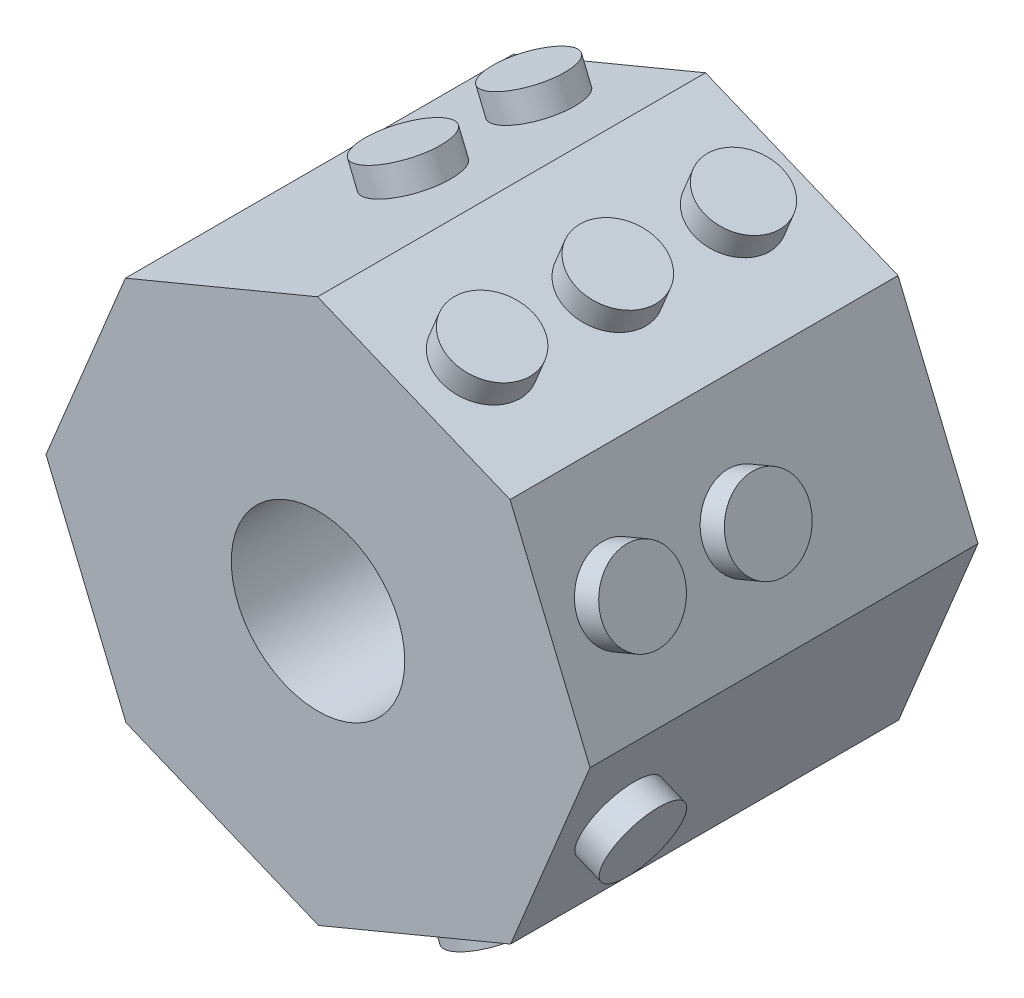
ISO-10303-21;
HEADER;
FILE_DESCRIPTION(('STEP AP214'),'2;1');
FILE_NAME('part.step','',(''),(''),'','','');
FILE_SCHEMA(('AUTOMOTIVE_DESIGN { 1 0 10303 214 1 1 1 1 }'));
ENDSEC;
DATA;
#1=APPLICATION_CONTEXT('core data for automotive mechanical design processes');
#2=APPLICATION_PROTOCOL_DEFINITION('international standard','automotive_design',2000,#1);
#3=PRODUCT_CONTEXT('',#1,'mechanical');
#4=PRODUCT('Part','Part','',(#3));
#5=PRODUCT_RELATED_PRODUCT_CATEGORY('part','',(#4));
#6=PRODUCT_DEFINITION_FORMATION('','',#4);
#7=PRODUCT_DEFINITION_CONTEXT('part definition',#1,'design');
#8=PRODUCT_DEFINITION('design','',#6,#7);
#9=PRODUCT_DEFINITION_SHAPE('','',#8);
#10=(LENGTH_UNIT() NAMED_UNIT(*) SI_UNIT(.MILLI.,.METRE.));
#11=(NAMED_UNIT(*) PLANE_ANGLE_UNIT() SI_UNIT($,.RADIAN.));
#12=(NAMED_UNIT(*) SI_UNIT($,.STERADIAN.) SOLID_ANGLE_UNIT());
#13=UNCERTAINTY_MEASURE_WITH_UNIT(LENGTH_MEASURE(1.E-05),#10,'distance_accuracy_value','');
#14=(GEOMETRIC_REPRESENTATION_CONTEXT(3) GLOBAL_UNCERTAINTY_ASSIGNED_CONTEXT((#13)) GLOBAL_UNIT_ASSIGNED_CONTEXT((#10,
#11,#12)) REPRESENTATION_CONTEXT('',''));
#15=CARTESIAN_POINT('',(0.,0.,0.));
#16=DIRECTION('',(0.,0.,1.));
#17=DIRECTION('',(1.,0.,0.));
#18=AXIS2_PLACEMENT_3D('',#15,#16,#17);
#19=CARTESIAN_POINT('',(3.51446046135657,3.52549293176761,7.1));
#20=DIRECTION('',(-0.381235131692321,-0.924478109185685,0.));
#21=DIRECTION('',(0.924478109185685,-0.381235131692321,0.));
#22=AXIS2_PLACEMENT_3D('',#19,#20,#21);
#23=PLANE('',#22);
#24=CARTESIAN_POINT('',(1.75332966335784,4.25174585764148,5.85));
#25=DIRECTION('',(-0.381235131692321,-0.924478109185685,0.));
#26=DIRECTION('',(0.924478109185685,-0.381235131692321,0.));
#27=AXIS2_PLACEMENT_3D('',#24,#25,#26);
#28=CIRCLE('',#27,0.75);
#29=CARTESIAN_POINT('',(2.44668824524711,3.96581950887224,5.85));
#30=VERTEX_POINT('',#29);
#31=EDGE_CURVE('E195',#30,#30,#28,.F.);
#32=ORIENTED_EDGE('',*,*,#31,.F.);
#33=EDGE_LOOP('',(#32));
#34=FACE_BOUND('',#33,.T.);
#35=CARTESIAN_POINT('',(1.75332966335784,4.25174585764148,3.55));
#36=DIRECTION('',(-0.381235131692321,-0.924478109185685,0.));
#37=DIRECTION('',(0.924478109185685,-0.381235131692321,0.));
#38=AXIS2_PLACEMENT_3D('',#35,#36,#37);
#39=CIRCLE('',#38,0.75);
#40=CARTESIAN_POINT('',(2.44668824524711,3.96581950887224,3.55));
#41=VERTEX_POINT('',#40);
#42=EDGE_CURVE('E191',#41,#41,#39,.F.);
#43=ORIENTED_EDGE('',*,*,#42,.F.);
#44=EDGE_LOOP('',(#43));
#45=FACE_BOUND('',#44,.T.);
#46=CARTESIAN_POINT('',(1.75332966335784,4.25174585764148,1.25));
#47=DIRECTION('',(-0.381235131692321,-0.924478109185685,0.));
#48=DIRECTION('',(0.924478109185685,-0.381235131692321,0.));
#49=AXIS2_PLACEMENT_3D('',#46,#47,#48);
#50=CIRCLE('',#49,0.714611453156265);
#51=CARTESIAN_POINT('',(2.41397230837418,3.97931086618861,1.25));
#52=VERTEX_POINT('',#51);
#53=EDGE_CURVE('E187',#52,#52,#50,.F.);
#54=ORIENTED_EDGE('',*,*,#53,.F.);
#55=EDGE_LOOP('',(#54));
#56=FACE_BOUND('',#55,.T.);
#57=DIRECTION('',(-0.924478109185685,0.381235131692321,0.));
#58=VECTOR('',#57,1.);
#59=CARTESIAN_POINT('',(3.51446046135657,3.52549293176761,0.));
#60=LINE('',#59,#58);
#61=CARTESIAN_POINT('',(3.51446046135657,3.52549293176761,0.));
#62=VERTEX_POINT('',#61);
#63=CARTESIAN_POINT('',(-0.00780113464088632,4.97799878351535,0.));
#64=VERTEX_POINT('',#63);
#65=EDGE_CURVE('E142',#62,#64,#60,.T.);
#66=ORIENTED_EDGE('',*,*,#65,.T.);
#67=DIRECTION('',(0.,0.,-1.));
#68=VECTOR('',#67,1.);
#69=CARTESIAN_POINT('',(-0.00780113464088632,4.97799878351535,7.1));
#70=LINE('',#69,#68);
#71=CARTESIAN_POINT('',(-0.00780113464088632,4.97799878351535,7.1));
#72=VERTEX_POINT('',#71);
#73=EDGE_CURVE('E184',#72,#64,#70,.T.);
#74=ORIENTED_EDGE('',*,*,#73,.F.);
#75=DIRECTION('',(-0.924478109185685,0.381235131692321,0.));
#76=VECTOR('',#75,1.);
#77=CARTESIAN_POINT('',(3.51446046135657,3.52549293176761,7.1));
#78=LINE('',#77,#76);
#79=CARTESIAN_POINT('',(3.51446046135657,3.52549293176761,7.1));
#80=VERTEX_POINT('',#79);
#81=EDGE_CURVE('E165',#80,#72,#78,.T.);
#82=ORIENTED_EDGE('',*,*,#81,.F.);
#83=DIRECTION('',(0.,0.,-1.));
#84=VECTOR('',#83,1.);
#85=CARTESIAN_POINT('',(3.51446046135657,3.52549293176761,7.1));
#86=LINE('',#85,#84);
#87=EDGE_CURVE('E138',#80,#62,#86,.T.);
#88=ORIENTED_EDGE('',*,*,#87,.T.);
#89=EDGE_LOOP('',(#66,#74,#82,#88));
#90=FACE_BOUND('',#89,.T.);
#91=ADVANCED_FACE('F39',(#34,#45,#56,#90),#23,.F.);
#92=CARTESIAN_POINT('',(-0.00780113464088632,4.97799878351535,7.1));
#93=DIRECTION('',(0.384130793217529,-0.923278686909902,0.));
#94=DIRECTION('',(0.923278686909902,0.384130793217529,0.));
#95=AXIS2_PLACEMENT_3D('',#92,#93,#94);
#96=PLANE('',#95);
#97=CARTESIAN_POINT('',(-1.81099768023092,4.22777750233007,3.55));
#98=DIRECTION('',(0.384130793217529,-0.923278686909902,0.));
#99=DIRECTION('',(0.923278686909902,0.384130793217529,0.));
#100=AXIS2_PLACEMENT_3D('',#97,#98,#99);
#101=CIRCLE('',#100,0.75);
#102=CARTESIAN_POINT('',(-1.1185386650485,4.51587559724322,3.55));
#103=VERTEX_POINT('',#102);
#104=EDGE_CURVE('E219',#103,#103,#101,.F.);
#105=ORIENTED_EDGE('',*,*,#104,.F.);
#106=EDGE_LOOP('',(#105));
#107=FACE_BOUND('',#106,.T.);
#108=CARTESIAN_POINT('',(-1.81099768023092,4.22777750233007,1.25));
#109=DIRECTION('',(0.384130793217529,-0.923278686909902,0.));
#110=DIRECTION('',(0.923278686909902,0.384130793217529,0.));
#111=AXIS2_PLACEMENT_3D('',#108,#109,#110);
#112=CIRCLE('',#111,0.714611453156265);
#113=CARTESIAN_POINT('',(-1.15121215611003,4.50228176667332,1.25));
#114=VERTEX_POINT('',#113);
#115=EDGE_CURVE('E216',#114,#114,#112,.F.);
#116=ORIENTED_EDGE('',*,*,#115,.F.);
#117=EDGE_LOOP('',(#116));
#118=FACE_BOUND('',#117,.T.);
#119=DIRECTION('',(-0.923278686909902,-0.384130793217528,0.));
#120=VECTOR('',#119,1.);
#121=CARTESIAN_POINT('',(-0.00780113464088632,4.97799878351535,0.));
#122=LINE('',#121,#120);
#123=CARTESIAN_POINT('',(-3.52549293176761,3.51446046135657,0.));
#124=VERTEX_POINT('',#123);
#125=EDGE_CURVE('E146',#64,#124,#122,.T.);
#126=ORIENTED_EDGE('',*,*,#125,.T.);
#127=DIRECTION('',(0.,0.,-1.));
#128=VECTOR('',#127,1.);
#129=CARTESIAN_POINT('',(-3.52549293176761,3.51446046135657,7.1));
#130=LINE('',#129,#128);
#131=CARTESIAN_POINT('',(-3.52549293176761,3.51446046135657,7.1));
#132=VERTEX_POINT('',#131);
#133=EDGE_CURVE('E180',#132,#124,#130,.T.);
#134=ORIENTED_EDGE('',*,*,#133,.F.);
#135=DIRECTION('',(-0.923278686909902,-0.384130793217528,0.));
#136=VECTOR('',#135,1.);
#137=CARTESIAN_POINT('',(-0.00780113464088632,4.97799878351535,7.1));
#138=LINE('',#137,#136);
#139=EDGE_CURVE('E101',#72,#132,#138,.T.);
#140=ORIENTED_EDGE('',*,*,#139,.F.);
#141=ORIENTED_EDGE('',*,*,#73,.T.);
#142=EDGE_LOOP('',(#126,#134,#140,#141));
#143=FACE_BOUND('',#142,.T.);
#144=ADVANCED_FACE('F234',(#107,#118,#143),#96,.F.);
#145=CARTESIAN_POINT('',(-3.52549293176761,3.51446046135657,7.1));
#146=DIRECTION('',(0.924478109185685,-0.381235131692321,0.));
#147=DIRECTION('',(0.381235131692321,0.924478109185685,0.));
#148=AXIS2_PLACEMENT_3D('',#145,#146,#147);
#149=PLANE('',#148);
#150=CARTESIAN_POINT('',(-4.25174585764148,1.75332966335784,1.25));
#151=DIRECTION('',(0.924478109185685,-0.381235131692321,0.));
#152=DIRECTION('',(0.381235131692321,0.924478109185685,0.));
#153=AXIS2_PLACEMENT_3D('',#150,#151,#152);
#154=CIRCLE('',#153,0.714611453156264);
#155=CARTESIAN_POINT('',(-3.97931086618861,2.41397230837418,1.25));
#156=VERTEX_POINT('',#155);
#157=EDGE_CURVE('E42',#156,#156,#154,.F.);
#158=ORIENTED_EDGE('',*,*,#157,.F.);
#159=EDGE_LOOP('',(#158));
#160=FACE_BOUND('',#159,.T.);
#161=DIRECTION('',(-0.381235131692321,-0.924478109185685,0.));
#162=VECTOR('',#161,1.);
#163=CARTESIAN_POINT('',(-3.52549293176761,3.51446046135657,0.));
#164=LINE('',#163,#162);
#165=CARTESIAN_POINT('',(-4.97799878351535,-0.00780113464088846,0.));
#166=VERTEX_POINT('',#165);
#167=EDGE_CURVE('E150',#124,#166,#164,.T.);
#168=ORIENTED_EDGE('',*,*,#167,.T.);
#169=DIRECTION('',(0.,0.,-1.));
#170=VECTOR('',#169,1.);
#171=CARTESIAN_POINT('',(-4.97799878351535,-0.00780113464088846,7.1));
#172=LINE('',#171,#170);
#173=CARTESIAN_POINT('',(-4.97799878351535,-0.00780113464088846,7.1));
#174=VERTEX_POINT('',#173);
#175=EDGE_CURVE('E176',#174,#166,#172,.T.);
#176=ORIENTED_EDGE('',*,*,#175,.F.);
#177=DIRECTION('',(-0.381235131692321,-0.924478109185685,0.));
#178=VECTOR('',#177,1.);
#179=CARTESIAN_POINT('',(-3.52549293176761,3.51446046135657,7.1));
#180=LINE('',#179,#178);
#181=EDGE_CURVE('E252',#132,#174,#180,.T.);
#182=ORIENTED_EDGE('',*,*,#181,.F.);
#183=ORIENTED_EDGE('',*,*,#133,.T.);
#184=EDGE_LOOP('',(#168,#176,#182,#183));
#185=FACE_BOUND('',#184,.T.);
#186=ADVANCED_FACE('F230',(#160,#185),#149,.F.);
#187=CARTESIAN_POINT('',(-4.97799878351535,-0.00780113464088846,7.1));
#188=DIRECTION('',(0.923278686909902,0.384130793217529,0.));
#189=DIRECTION('',(-0.384130793217529,0.923278686909902,0.));
#190=AXIS2_PLACEMENT_3D('',#187,#188,#189);
#191=PLANE('',#190);
#192=DIRECTION('',(0.384130793217528,-0.923278686909902,0.));
#193=VECTOR('',#192,1.);
#194=CARTESIAN_POINT('',(-4.97799878351535,-0.00780113464088846,0.));
#195=LINE('',#194,#193);
#196=CARTESIAN_POINT('',(-3.51446046135657,-3.52549293176761,0.));
#197=VERTEX_POINT('',#196);
#198=EDGE_CURVE('E153',#166,#197,#195,.T.);
#199=ORIENTED_EDGE('',*,*,#198,.T.);
#200=DIRECTION('',(0.,0.,-1.));
#201=VECTOR('',#200,1.);
#202=CARTESIAN_POINT('',(-3.51446046135657,-3.52549293176761,7.1));
#203=LINE('',#202,#201);
#204=CARTESIAN_POINT('',(-3.51446046135657,-3.52549293176761,7.1));
#205=VERTEX_POINT('',#204);
#206=EDGE_CURVE('E172',#205,#197,#203,.T.);
#207=ORIENTED_EDGE('',*,*,#206,.F.);
#208=DIRECTION('',(0.384130793217528,-0.923278686909902,0.));
#209=VECTOR('',#208,1.);
#210=CARTESIAN_POINT('',(-4.97799878351535,-0.00780113464088846,7.1));
#211=LINE('',#210,#209);
#212=EDGE_CURVE('E244',#174,#205,#211,.T.);
#213=ORIENTED_EDGE('',*,*,#212,.F.);
#214=ORIENTED_EDGE('',*,*,#175,.T.);
#215=EDGE_LOOP('',(#199,#207,#213,#214));
#216=FACE_BOUND('',#215,.T.);
#217=ADVANCED_FACE('F233',(#216),#191,.F.);
#218=CARTESIAN_POINT('',(-3.51446046135657,-3.52549293176761,7.1));
#219=DIRECTION('',(0.381235131692321,0.924478109185685,0.));
#220=DIRECTION('',(-0.924478109185685,0.381235131692321,0.));
#221=AXIS2_PLACEMENT_3D('',#218,#219,#220);
#222=PLANE('',#221);
#223=CARTESIAN_POINT('',(-1.75332966335784,-4.25174585764149,3.55));
#224=DIRECTION('',(-0.38123513169232,-0.924478109185685,0.));
#225=DIRECTION('',(0.924478109185685,-0.38123513169232,0.));
#226=AXIS2_PLACEMENT_3D('',#223,#224,#225);
#227=CIRCLE('',#226,0.75);
#228=CARTESIAN_POINT('',(-1.05997108146858,-4.53767220641073,3.55));
#229=VERTEX_POINT('',#228);
#230=EDGE_CURVE('E11',#229,#229,#227,.T.);
#231=ORIENTED_EDGE('',*,*,#230,.F.);
#232=EDGE_LOOP('',(#231));
#233=FACE_BOUND('',#232,.T.);
#234=DIRECTION('',(0.924478109185685,-0.381235131692321,0.));
#235=VECTOR('',#234,1.);
#236=CARTESIAN_POINT('',(-3.51446046135657,-3.52549293176761,0.));
#237=LINE('',#236,#235);
#238=CARTESIAN_POINT('',(0.00780113464088743,-4.97799878351536,0.));
#239=VERTEX_POINT('',#238);
#240=EDGE_CURVE('E156',#197,#239,#237,.T.);
#241=ORIENTED_EDGE('',*,*,#240,.T.);
#242=DIRECTION('',(0.,0.,-1.));
#243=VECTOR('',#242,1.);
#244=CARTESIAN_POINT('',(0.00780113464088743,-4.97799878351536,7.1));
#245=LINE('',#244,#243);
#246=CARTESIAN_POINT('',(0.00780113464088743,-4.97799878351536,7.1));
#247=VERTEX_POINT('',#246);
#248=EDGE_CURVE('E131',#247,#239,#245,.T.);
#249=ORIENTED_EDGE('',*,*,#248,.F.);
#250=DIRECTION('',(0.924478109185685,-0.381235131692321,0.));
#251=VECTOR('',#250,1.);
#252=CARTESIAN_POINT('',(-3.51446046135657,-3.52549293176761,7.1));
#253=LINE('',#252,#251);
#254=EDGE_CURVE('E120',#205,#247,#253,.T.);
#255=ORIENTED_EDGE('',*,*,#254,.F.);
#256=ORIENTED_EDGE('',*,*,#206,.T.);
#257=EDGE_LOOP('',(#241,#249,#255,#256));
#258=FACE_BOUND('',#257,.T.);
#259=ADVANCED_FACE('F249',(#233,#258),#222,.F.);
#260=CARTESIAN_POINT('',(0.00780113464088743,-4.97799878351536,7.1));
#261=DIRECTION('',(-0.384130793217528,0.923278686909902,0.));
#262=DIRECTION('',(-0.923278686909902,-0.384130793217529,0.));
#263=AXIS2_PLACEMENT_3D('',#260,#261,#262);
#264=PLANE('',#263);
#265=CARTESIAN_POINT('',(1.76664703320425,-4.24622962243596,1.25));
#266=DIRECTION('',(-0.384130793217528,0.923278686909902,0.));
#267=DIRECTION('',(-0.923278686909902,-0.384130793217529,0.));
#268=AXIS2_PLACEMENT_3D('',#265,#266,#267);
#269=CIRCLE('',#268,0.75);
#270=CARTESIAN_POINT('',(1.07418801802182,-4.53432771734911,1.25));
#271=VERTEX_POINT('',#270);
#272=EDGE_CURVE('E212',#271,#271,#269,.F.);
#273=ORIENTED_EDGE('',*,*,#272,.F.);
#274=EDGE_LOOP('',(#273));
#275=FACE_BOUND('',#274,.T.);
#276=CARTESIAN_POINT('',(1.76664703320425,-4.24622962243596,5.85));
#277=DIRECTION('',(-0.384130793217528,0.923278686909902,0.));
#278=DIRECTION('',(-0.923278686909902,-0.384130793217529,0.));
#279=AXIS2_PLACEMENT_3D('',#276,#277,#278);
#280=CIRCLE('',#279,0.714611453156265);
#281=CARTESIAN_POINT('',(1.10686150908336,-4.52073388677921,5.85));
#282=VERTEX_POINT('',#281);
#283=EDGE_CURVE('E208',#282,#282,#280,.F.);
#284=ORIENTED_EDGE('',*,*,#283,.F.);
#285=EDGE_LOOP('',(#284));
#286=FACE_BOUND('',#285,.T.);
#287=DIRECTION('',(0.923278686909902,0.384130793217528,0.));
#288=VECTOR('',#287,1.);
#289=CARTESIAN_POINT('',(0.00780113464088743,-4.97799878351536,0.));
#290=LINE('',#289,#288);
#291=CARTESIAN_POINT('',(3.52549293176761,-3.51446046135657,0.));
#292=VERTEX_POINT('',#291);
#293=EDGE_CURVE('E129',#239,#292,#290,.T.);
#294=ORIENTED_EDGE('',*,*,#293,.T.);
#295=DIRECTION('',(0.,0.,-1.));
#296=VECTOR('',#295,1.);
#297=CARTESIAN_POINT('',(3.52549293176761,-3.51446046135657,7.1));
#298=LINE('',#297,#296);
#299=CARTESIAN_POINT('',(3.52549293176761,-3.51446046135657,7.1));
#300=VERTEX_POINT('',#299);
#301=EDGE_CURVE('E126',#300,#292,#298,.T.);
#302=ORIENTED_EDGE('',*,*,#301,.F.);
#303=DIRECTION('',(0.923278686909902,0.384130793217528,0.));
#304=VECTOR('',#303,1.);
#305=CARTESIAN_POINT('',(0.00780113464088743,-4.97799878351536,7.1));
#306=LINE('',#305,#304);
#307=EDGE_CURVE('E114',#247,#300,#306,.T.);
#308=ORIENTED_EDGE('',*,*,#307,.F.);
#309=ORIENTED_EDGE('',*,*,#248,.T.);
#310=EDGE_LOOP('',(#294,#302,#308,#309));
#311=FACE_BOUND('',#310,.T.);
#312=ADVANCED_FACE('F127',(#275,#286,#311),#264,.F.);
#313=CARTESIAN_POINT('',(3.52549293176761,-3.51446046135657,7.1));
#314=DIRECTION('',(-0.924478109185685,0.381235131692321,0.));
#315=DIRECTION('',(-0.381235131692321,-0.924478109185685,0.));
#316=AXIS2_PLACEMENT_3D('',#313,#314,#315);
#317=PLANE('',#316);
#318=CARTESIAN_POINT('',(4.25174585764149,-1.75332966335784,5.85));
#319=DIRECTION('',(-0.924478109185685,0.381235131692321,0.));
#320=DIRECTION('',(-0.381235131692321,-0.924478109185685,0.));
#321=AXIS2_PLACEMENT_3D('',#318,#319,#320);
#322=CIRCLE('',#321,0.75);
#323=CARTESIAN_POINT('',(3.96581950887224,-2.44668824524711,5.85));
#324=VERTEX_POINT('',#323);
#325=EDGE_CURVE('E204',#324,#324,#322,.F.);
#326=ORIENTED_EDGE('',*,*,#325,.F.);
#327=EDGE_LOOP('',(#326));
#328=FACE_BOUND('',#327,.T.);
#329=DIRECTION('',(0.381235131692321,0.924478109185685,0.));
#330=VECTOR('',#329,1.);
#331=CARTESIAN_POINT('',(3.52549293176761,-3.51446046135657,0.));
#332=LINE('',#331,#330);
#333=CARTESIAN_POINT('',(4.97799878351536,0.0078011346408868,0.));
#334=VERTEX_POINT('',#333);
#335=EDGE_CURVE('E86',#292,#334,#332,.T.);
#336=ORIENTED_EDGE('',*,*,#335,.T.);
#337=DIRECTION('',(0.,0.,-1.));
#338=VECTOR('',#337,1.);
#339=CARTESIAN_POINT('',(4.97799878351536,0.0078011346408868,7.1));
#340=LINE('',#339,#338);
#341=CARTESIAN_POINT('',(4.97799878351536,0.0078011346408868,7.1));
#342=VERTEX_POINT('',#341);
#343=EDGE_CURVE('E132',#342,#334,#340,.T.);
#344=ORIENTED_EDGE('',*,*,#343,.F.);
#345=DIRECTION('',(0.381235131692321,0.924478109185685,0.));
#346=VECTOR('',#345,1.);
#347=CARTESIAN_POINT('',(3.52549293176761,-3.51446046135657,7.1));
#348=LINE('',#347,#346);
#349=EDGE_CURVE('E118',#300,#342,#348,.T.);
#350=ORIENTED_EDGE('',*,*,#349,.F.);
#351=ORIENTED_EDGE('',*,*,#301,.T.);
#352=EDGE_LOOP('',(#336,#344,#350,#351));
#353=FACE_BOUND('',#352,.T.);
#354=ADVANCED_FACE('F134',(#328,#353),#317,.F.);
#355=CARTESIAN_POINT('',(4.97799878351536,0.0078011346408868,7.1));
#356=DIRECTION('',(-0.923278686909902,-0.384130793217528,0.));
#357=DIRECTION('',(0.384130793217528,-0.923278686909902,0.));
#358=AXIS2_PLACEMENT_3D('',#355,#356,#357);
#359=PLANE('',#358);
#360=CARTESIAN_POINT('',(4.24622962243597,1.76664703320425,5.85));
#361=DIRECTION('',(-0.923278686909902,-0.384130793217528,0.));
#362=DIRECTION('',(0.384130793217528,-0.923278686909902,0.));
#363=AXIS2_PLACEMENT_3D('',#360,#361,#362);
#364=CIRCLE('',#363,0.750000000000001);
#365=CARTESIAN_POINT('',(4.53432771734911,1.07418801802182,5.85));
#366=VERTEX_POINT('',#365);
#367=EDGE_CURVE('E200',#366,#366,#364,.F.);
#368=ORIENTED_EDGE('',*,*,#367,.F.);
#369=EDGE_LOOP('',(#368));
#370=FACE_BOUND('',#369,.T.);
#371=CARTESIAN_POINT('',(4.24622962243597,1.76664703320425,3.55));
#372=DIRECTION('',(0.923278686909902,0.384130793217528,0.));
#373=DIRECTION('',(-0.384130793217528,0.923278686909902,0.));
#374=AXIS2_PLACEMENT_3D('',#371,#372,#373);
#375=CIRCLE('',#374,0.75);
#376=CARTESIAN_POINT('',(3.95813152752282,2.45910604838668,3.55));
#377=VERTEX_POINT('',#376);
#378=EDGE_CURVE('E199',#377,#377,#375,.T.);
#379=ORIENTED_EDGE('',*,*,#378,.F.);
#380=EDGE_LOOP('',(#379));
#381=FACE_BOUND('',#380,.T.);
#382=DIRECTION('',(-0.384130793217528,0.923278686909902,0.));
#383=VECTOR('',#382,1.);
#384=CARTESIAN_POINT('',(4.97799878351536,0.0078011346408868,0.));
#385=LINE('',#384,#383);
#386=EDGE_CURVE('E92',#334,#62,#385,.T.);
#387=ORIENTED_EDGE('',*,*,#386,.T.);
#388=ORIENTED_EDGE('',*,*,#87,.F.);
#389=DIRECTION('',(-0.384130793217528,0.923278686909902,0.));
#390=VECTOR('',#389,1.);
#391=CARTESIAN_POINT('',(4.97799878351536,0.0078011346408868,7.1));
#392=LINE('',#391,#390);
#393=EDGE_CURVE('E57',#342,#80,#392,.T.);
#394=ORIENTED_EDGE('',*,*,#393,.F.);
#395=ORIENTED_EDGE('',*,*,#343,.T.);
#396=EDGE_LOOP('',(#387,#388,#394,#395));
#397=FACE_BOUND('',#396,.T.);
#398=ADVANCED_FACE('F329',(#370,#381,#397),#359,.F.);
#399=CARTESIAN_POINT('',(0.,0.,7.1));
#400=DIRECTION('',(0.,0.,1.));
#401=DIRECTION('',(1.,0.,0.));
#402=AXIS2_PLACEMENT_3D('',#399,#400,#401);
#403=PLANE('',#402);
#404=CARTESIAN_POINT('',(0.,0.,7.1));
#405=DIRECTION('',(0.,0.,1.));
#406=DIRECTION('',(1.,0.,0.));
#407=AXIS2_PLACEMENT_3D('',#404,#405,#406);
#408=CIRCLE('',#407,1.5875);
#409=CARTESIAN_POINT('',(1.5875,0.,7.1));
#410=VERTEX_POINT('',#409);
#411=EDGE_CURVE('E312',#410,#410,#408,.T.);
#412=ORIENTED_EDGE('',*,*,#411,.F.);
#413=EDGE_LOOP('',(#412));
#414=FACE_BOUND('',#413,.T.);
#415=ORIENTED_EDGE('',*,*,#81,.T.);
#416=ORIENTED_EDGE('',*,*,#139,.T.);
#417=ORIENTED_EDGE('',*,*,#181,.T.);
#418=ORIENTED_EDGE('',*,*,#212,.T.);
#419=ORIENTED_EDGE('',*,*,#254,.T.);
#420=ORIENTED_EDGE('',*,*,#307,.T.);
#421=ORIENTED_EDGE('',*,*,#349,.T.);
#422=ORIENTED_EDGE('',*,*,#393,.T.);
#423=EDGE_LOOP('',(#415,#416,#417,#418,#419,#420,#421,#422));
#424=FACE_BOUND('',#423,.T.);
#425=ADVANCED_FACE('F116',(#414,#424),#403,.T.);
#426=CARTESIAN_POINT('',(0.,0.,0.));
#427=DIRECTION('',(0.,0.,1.));
#428=DIRECTION('',(1.,0.,0.));
#429=AXIS2_PLACEMENT_3D('',#426,#427,#428);
#430=PLANE('',#429);
#431=CARTESIAN_POINT('',(0.,0.,0.));
#432=DIRECTION('',(0.,0.,1.));
#433=DIRECTION('',(1.,0.,0.));
#434=AXIS2_PLACEMENT_3D('',#431,#432,#433);
#435=CIRCLE('',#434,1.5875);
#436=CARTESIAN_POINT('',(1.5875,0.,0.));
#437=VERTEX_POINT('',#436);
#438=EDGE_CURVE('E311',#437,#437,#435,.T.);
#439=ORIENTED_EDGE('',*,*,#438,.T.);
#440=EDGE_LOOP('',(#439));
#441=FACE_BOUND('',#440,.T.);
#442=ORIENTED_EDGE('',*,*,#65,.F.);
#443=ORIENTED_EDGE('',*,*,#386,.F.);
#444=ORIENTED_EDGE('',*,*,#335,.F.);
#445=ORIENTED_EDGE('',*,*,#293,.F.);
#446=ORIENTED_EDGE('',*,*,#240,.F.);
#447=ORIENTED_EDGE('',*,*,#198,.F.);
#448=ORIENTED_EDGE('',*,*,#167,.F.);
#449=ORIENTED_EDGE('',*,*,#125,.F.);
#450=EDGE_LOOP('',(#442,#443,#444,#445,#446,#447,#448,#449));
#451=FACE_BOUND('',#450,.T.);
#452=ADVANCED_FACE('F247',(#441,#451),#430,.F.);
#453=CARTESIAN_POINT('',(1.93632252657016,4.69549535005061,1.25));
#454=DIRECTION('',(-0.381235131692321,-0.924478109185685,0.));
#455=DIRECTION('',(0.924478109185685,-0.381235131692321,0.));
#456=AXIS2_PLACEMENT_3D('',#453,#454,#455);
#457=CYLINDRICAL_SURFACE('',#456,0.714611453156265);
#458=CARTESIAN_POINT('',(1.93632252657016,4.69549535005061,1.25));
#459=DIRECTION('',(0.381235131692321,0.924478109185685,0.));
#460=DIRECTION('',(-0.924478109185685,0.381235131692321,0.));
#461=AXIS2_PLACEMENT_3D('',#458,#459,#460);
#462=CIRCLE('',#461,0.714611453156265);
#463=CARTESIAN_POINT('',(1.27567988155382,4.96793034150348,1.25));
#464=VERTEX_POINT('',#463);
#465=EDGE_CURVE('E147',#464,#464,#462,.T.);
#466=ORIENTED_EDGE('',*,*,#465,.F.);
#467=EDGE_LOOP('',(#466));
#468=FACE_BOUND('',#467,.T.);
#469=ORIENTED_EDGE('',*,*,#53,.T.);
#470=EDGE_LOOP('',(#469));
#471=FACE_BOUND('',#470,.T.);
#472=ADVANCED_FACE('F335',(#468,#471),#457,.T.);
#473=CARTESIAN_POINT('',(1.93632252657016,4.69549535005061,1.25));
#474=DIRECTION('',(0.381235131692321,0.924478109185685,0.));
#475=DIRECTION('',(-0.924478109185685,0.381235131692321,0.));
#476=AXIS2_PLACEMENT_3D('',#473,#474,#475);
#477=PLANE('',#476);
#478=ORIENTED_EDGE('',*,*,#465,.T.);
#479=EDGE_LOOP('',(#478));
#480=FACE_BOUND('',#479,.T.);
#481=ADVANCED_FACE('F356',(#480),#477,.T.);
#482=CARTESIAN_POINT('',(1.93632252657016,4.69549535005061,3.55));
#483=DIRECTION('',(-0.381235131692321,-0.924478109185685,0.));
#484=DIRECTION('',(0.924478109185685,-0.381235131692321,0.));
#485=AXIS2_PLACEMENT_3D('',#482,#483,#484);
#486=CYLINDRICAL_SURFACE('',#485,0.75);
#487=CARTESIAN_POINT('',(1.93632252657016,4.69549535005061,3.55));
#488=DIRECTION('',(0.381235131692321,0.924478109185685,0.));
#489=DIRECTION('',(-0.924478109185685,0.381235131692321,0.));
#490=AXIS2_PLACEMENT_3D('',#487,#488,#489);
#491=CIRCLE('',#490,0.75);
#492=CARTESIAN_POINT('',(1.24296394468089,4.98142169881985,3.55));
#493=VERTEX_POINT('',#492);
#494=EDGE_CURVE('E264',#493,#493,#491,.T.);
#495=ORIENTED_EDGE('',*,*,#494,.F.);
#496=EDGE_LOOP('',(#495));
#497=FACE_BOUND('',#496,.T.);
#498=ORIENTED_EDGE('',*,*,#42,.T.);
#499=EDGE_LOOP('',(#498));
#500=FACE_BOUND('',#499,.T.);
#501=ADVANCED_FACE('F361',(#497,#500),#486,.T.);
#502=CARTESIAN_POINT('',(1.93632252657016,4.69549535005061,3.55));
#503=DIRECTION('',(0.381235131692321,0.924478109185685,0.));
#504=DIRECTION('',(-0.924478109185685,0.381235131692321,0.));
#505=AXIS2_PLACEMENT_3D('',#502,#503,#504);
#506=PLANE('',#505);
#507=ORIENTED_EDGE('',*,*,#494,.T.);
#508=EDGE_LOOP('',(#507));
#509=FACE_BOUND('',#508,.T.);
#510=ADVANCED_FACE('F368',(#509),#506,.T.);
#511=CARTESIAN_POINT('',(1.93632252657016,4.69549535005061,5.85));
#512=DIRECTION('',(-0.381235131692321,-0.924478109185685,0.));
#513=DIRECTION('',(0.924478109185685,-0.381235131692321,0.));
#514=AXIS2_PLACEMENT_3D('',#511,#512,#513);
#515=CYLINDRICAL_SURFACE('',#514,0.75);
#516=CARTESIAN_POINT('',(1.93632252657016,4.69549535005061,5.85));
#517=DIRECTION('',(0.381235131692321,0.924478109185685,0.));
#518=DIRECTION('',(-0.924478109185685,0.381235131692321,0.));
#519=AXIS2_PLACEMENT_3D('',#516,#517,#518);
#520=CIRCLE('',#519,0.75);
#521=CARTESIAN_POINT('',(1.24296394468089,4.98142169881985,5.85));
#522=VERTEX_POINT('',#521);
#523=EDGE_CURVE('E268',#522,#522,#520,.T.);
#524=ORIENTED_EDGE('',*,*,#523,.F.);
#525=EDGE_LOOP('',(#524));
#526=FACE_BOUND('',#525,.T.);
#527=ORIENTED_EDGE('',*,*,#31,.T.);
#528=EDGE_LOOP('',(#527));
#529=FACE_BOUND('',#528,.T.);
#530=ADVANCED_FACE('F372',(#526,#529),#515,.T.);
#531=CARTESIAN_POINT('',(1.93632252657016,4.69549535005061,5.85));
#532=DIRECTION('',(0.381235131692321,0.924478109185685,0.));
#533=DIRECTION('',(-0.924478109185685,0.381235131692321,0.));
#534=AXIS2_PLACEMENT_3D('',#531,#532,#533);
#535=PLANE('',#534);
#536=ORIENTED_EDGE('',*,*,#523,.T.);
#537=EDGE_LOOP('',(#536));
#538=FACE_BOUND('',#537,.T.);
#539=ADVANCED_FACE('F376',(#538),#535,.T.);
#540=CARTESIAN_POINT('',(4.68940339215272,1.95102981394866,3.55));
#541=DIRECTION('',(-0.923278686909902,-0.384130793217528,0.));
#542=DIRECTION('',(0.384130793217528,-0.923278686909902,0.));
#543=AXIS2_PLACEMENT_3D('',#540,#541,#542);
#544=CYLINDRICAL_SURFACE('',#543,0.75);
#545=CARTESIAN_POINT('',(4.68940339215272,1.95102981394866,3.55));
#546=DIRECTION('',(0.923278686909902,0.384130793217528,0.));
#547=DIRECTION('',(-0.384130793217528,0.923278686909902,0.));
#548=AXIS2_PLACEMENT_3D('',#545,#546,#547);
#549=CIRCLE('',#548,0.75);
#550=CARTESIAN_POINT('',(4.40130529723957,2.64348882913109,3.55));
#551=VERTEX_POINT('',#550);
#552=EDGE_CURVE('E272',#551,#551,#549,.T.);
#553=ORIENTED_EDGE('',*,*,#552,.F.);
#554=EDGE_LOOP('',(#553));
#555=FACE_BOUND('',#554,.T.);
#556=ORIENTED_EDGE('',*,*,#378,.T.);
#557=EDGE_LOOP('',(#556));
#558=FACE_BOUND('',#557,.T.);
#559=ADVANCED_FACE('F380',(#555,#558),#544,.T.);
#560=CARTESIAN_POINT('',(4.68940339215272,1.95102981394866,3.55));
#561=DIRECTION('',(0.923278686909902,0.384130793217528,0.));
#562=DIRECTION('',(-0.384130793217528,0.923278686909902,0.));
#563=AXIS2_PLACEMENT_3D('',#560,#561,#562);
#564=PLANE('',#563);
#565=ORIENTED_EDGE('',*,*,#552,.T.);
#566=EDGE_LOOP('',(#565));
#567=FACE_BOUND('',#566,.T.);
#568=ADVANCED_FACE('F384',(#567),#564,.T.);
#569=CARTESIAN_POINT('',(4.68940339215272,1.95102981394866,5.85));
#570=DIRECTION('',(-0.923278686909902,-0.384130793217528,0.));
#571=DIRECTION('',(0.384130793217528,-0.923278686909902,0.));
#572=AXIS2_PLACEMENT_3D('',#569,#570,#571);
#573=CYLINDRICAL_SURFACE('',#572,0.750000000000001);
#574=CARTESIAN_POINT('',(4.68940339215272,1.95102981394866,5.85));
#575=DIRECTION('',(0.923278686909902,0.384130793217528,0.));
#576=DIRECTION('',(-0.384130793217528,0.923278686909902,0.));
#577=AXIS2_PLACEMENT_3D('',#574,#575,#576);
#578=CIRCLE('',#577,0.750000000000001);
#579=CARTESIAN_POINT('',(4.40130529723957,2.64348882913109,5.85));
#580=VERTEX_POINT('',#579);
#581=EDGE_CURVE('E279',#580,#580,#578,.T.);
#582=ORIENTED_EDGE('',*,*,#581,.F.);
#583=EDGE_LOOP('',(#582));
#584=FACE_BOUND('',#583,.T.);
#585=ORIENTED_EDGE('',*,*,#367,.T.);
#586=EDGE_LOOP('',(#585));
#587=FACE_BOUND('',#586,.T.);
#588=ADVANCED_FACE('F388',(#584,#587),#573,.T.);
#589=CARTESIAN_POINT('',(4.68940339215272,1.95102981394866,5.85));
#590=DIRECTION('',(0.923278686909902,0.384130793217528,0.));
#591=DIRECTION('',(-0.384130793217528,0.923278686909902,0.));
#592=AXIS2_PLACEMENT_3D('',#589,#590,#591);
#593=PLANE('',#592);
#594=ORIENTED_EDGE('',*,*,#581,.T.);
#595=EDGE_LOOP('',(#594));
#596=FACE_BOUND('',#595,.T.);
#597=ADVANCED_FACE('F392',(#596),#593,.T.);
#598=CARTESIAN_POINT('',(4.69549535005062,-1.93632252657016,5.85));
#599=DIRECTION('',(-0.924478109185685,0.381235131692321,0.));
#600=DIRECTION('',(-0.381235131692321,-0.924478109185685,0.));
#601=AXIS2_PLACEMENT_3D('',#598,#599,#600);
#602=CYLINDRICAL_SURFACE('',#601,0.75);
#603=CARTESIAN_POINT('',(4.69549535005062,-1.93632252657016,5.85));
#604=DIRECTION('',(0.924478109185685,-0.381235131692321,0.));
#605=DIRECTION('',(0.381235131692321,0.924478109185685,0.));
#606=AXIS2_PLACEMENT_3D('',#603,#604,#605);
#607=CIRCLE('',#606,0.75);
#608=CARTESIAN_POINT('',(4.98142169881986,-1.24296394468089,5.85));
#609=VERTEX_POINT('',#608);
#610=EDGE_CURVE('E283',#609,#609,#607,.T.);
#611=ORIENTED_EDGE('',*,*,#610,.F.);
#612=EDGE_LOOP('',(#611));
#613=FACE_BOUND('',#612,.T.);
#614=ORIENTED_EDGE('',*,*,#325,.T.);
#615=EDGE_LOOP('',(#614));
#616=FACE_BOUND('',#615,.T.);
#617=ADVANCED_FACE('F396',(#613,#616),#602,.T.);
#618=CARTESIAN_POINT('',(4.69549535005062,-1.93632252657016,5.85));
#619=DIRECTION('',(0.924478109185685,-0.381235131692321,0.));
#620=DIRECTION('',(0.381235131692321,0.924478109185685,0.));
#621=AXIS2_PLACEMENT_3D('',#618,#619,#620);
#622=PLANE('',#621);
#623=ORIENTED_EDGE('',*,*,#610,.T.);
#624=EDGE_LOOP('',(#623));
#625=FACE_BOUND('',#624,.T.);
#626=ADVANCED_FACE('F400',(#625),#622,.T.);
#627=CARTESIAN_POINT('',(1.95102981394866,-4.68940339215272,5.85));
#628=DIRECTION('',(-0.384130793217529,0.923278686909901,0.));
#629=DIRECTION('',(-0.923278686909901,-0.384130793217529,0.));
#630=AXIS2_PLACEMENT_3D('',#627,#628,#629);
#631=CYLINDRICAL_SURFACE('',#630,0.714611453156265);
#632=CARTESIAN_POINT('',(1.95102981394866,-4.68940339215272,5.85));
#633=DIRECTION('',(0.384130793217529,-0.923278686909901,0.));
#634=DIRECTION('',(0.923278686909901,0.384130793217529,0.));
#635=AXIS2_PLACEMENT_3D('',#632,#633,#634);
#636=CIRCLE('',#635,0.714611453156265);
#637=CARTESIAN_POINT('',(2.61081533806956,-4.41489912780947,5.85));
#638=VERTEX_POINT('',#637);
#639=EDGE_CURVE('E287',#638,#638,#636,.T.);
#640=ORIENTED_EDGE('',*,*,#639,.F.);
#641=EDGE_LOOP('',(#640));
#642=FACE_BOUND('',#641,.T.);
#643=ORIENTED_EDGE('',*,*,#283,.T.);
#644=EDGE_LOOP('',(#643));
#645=FACE_BOUND('',#644,.T.);
#646=ADVANCED_FACE('F404',(#642,#645),#631,.T.);
#647=CARTESIAN_POINT('',(1.95102981394866,-4.68940339215272,5.85));
#648=DIRECTION('',(0.384130793217529,-0.923278686909901,0.));
#649=DIRECTION('',(0.923278686909901,0.384130793217529,0.));
#650=AXIS2_PLACEMENT_3D('',#647,#648,#649);
#651=PLANE('',#650);
#652=ORIENTED_EDGE('',*,*,#639,.T.);
#653=EDGE_LOOP('',(#652));
#654=FACE_BOUND('',#653,.T.);
#655=ADVANCED_FACE('F408',(#654),#651,.T.);
#656=CARTESIAN_POINT('',(1.95102981394866,-4.68940339215272,1.25));
#657=DIRECTION('',(-0.384130793217529,0.923278686909901,0.));
#658=DIRECTION('',(-0.923278686909901,-0.384130793217529,0.));
#659=AXIS2_PLACEMENT_3D('',#656,#657,#658);
#660=CYLINDRICAL_SURFACE('',#659,0.75);
#661=CARTESIAN_POINT('',(1.95102981394866,-4.68940339215272,1.25));
#662=DIRECTION('',(0.384130793217529,-0.923278686909901,0.));
#663=DIRECTION('',(0.923278686909901,0.384130793217529,0.));
#664=AXIS2_PLACEMENT_3D('',#661,#662,#663);
#665=CIRCLE('',#664,0.75);
#666=CARTESIAN_POINT('',(2.64348882913109,-4.40130529723957,1.25));
#667=VERTEX_POINT('',#666);
#668=EDGE_CURVE('E291',#667,#667,#665,.T.);
#669=ORIENTED_EDGE('',*,*,#668,.F.);
#670=EDGE_LOOP('',(#669));
#671=FACE_BOUND('',#670,.T.);
#672=ORIENTED_EDGE('',*,*,#272,.T.);
#673=EDGE_LOOP('',(#672));
#674=FACE_BOUND('',#673,.T.);
#675=ADVANCED_FACE('F412',(#671,#674),#660,.T.);
#676=CARTESIAN_POINT('',(1.95102981394866,-4.68940339215272,1.25));
#677=DIRECTION('',(0.384130793217529,-0.923278686909901,0.));
#678=DIRECTION('',(0.923278686909901,0.384130793217529,0.));
#679=AXIS2_PLACEMENT_3D('',#676,#677,#678);
#680=PLANE('',#679);
#681=ORIENTED_EDGE('',*,*,#668,.T.);
#682=EDGE_LOOP('',(#681));
#683=FACE_BOUND('',#682,.T.);
#684=ADVANCED_FACE('F416',(#683),#680,.T.);
#685=CARTESIAN_POINT('',(-1.99538046097534,4.67095127204683,1.25));
#686=DIRECTION('',(0.38413079321753,-0.923278686909901,0.));
#687=DIRECTION('',(0.923278686909901,0.38413079321753,0.));
#688=AXIS2_PLACEMENT_3D('',#685,#686,#687);
#689=CYLINDRICAL_SURFACE('',#688,0.714611453156265);
#690=CARTESIAN_POINT('',(-1.99538046097534,4.67095127204683,1.25));
#691=DIRECTION('',(-0.38413079321753,0.923278686909901,0.));
#692=DIRECTION('',(-0.923278686909901,-0.38413079321753,0.));
#693=AXIS2_PLACEMENT_3D('',#690,#691,#692);
#694=CIRCLE('',#693,0.714611453156265);
#695=CARTESIAN_POINT('',(-2.65516598509623,4.39644700770358,1.25));
#696=VERTEX_POINT('',#695);
#697=EDGE_CURVE('E295',#696,#696,#694,.T.);
#698=ORIENTED_EDGE('',*,*,#697,.F.);
#699=EDGE_LOOP('',(#698));
#700=FACE_BOUND('',#699,.T.);
#701=ORIENTED_EDGE('',*,*,#115,.T.);
#702=EDGE_LOOP('',(#701));
#703=FACE_BOUND('',#702,.T.);
#704=ADVANCED_FACE('F420',(#700,#703),#689,.T.);
#705=CARTESIAN_POINT('',(-1.99538046097534,4.67095127204683,1.25));
#706=DIRECTION('',(-0.38413079321753,0.923278686909901,0.));
#707=DIRECTION('',(-0.923278686909901,-0.38413079321753,0.));
#708=AXIS2_PLACEMENT_3D('',#705,#706,#707);
#709=PLANE('',#708);
#710=ORIENTED_EDGE('',*,*,#697,.T.);
#711=EDGE_LOOP('',(#710));
#712=FACE_BOUND('',#711,.T.);
#713=ADVANCED_FACE('F424',(#712),#709,.T.);
#714=CARTESIAN_POINT('',(-1.99538046097534,4.67095127204683,3.55));
#715=DIRECTION('',(0.38413079321753,-0.923278686909901,0.));
#716=DIRECTION('',(0.923278686909901,0.38413079321753,0.));
#717=AXIS2_PLACEMENT_3D('',#714,#715,#716);
#718=CYLINDRICAL_SURFACE('',#717,0.75);
#719=CARTESIAN_POINT('',(-1.99538046097534,4.67095127204683,3.55));
#720=DIRECTION('',(-0.38413079321753,0.923278686909901,0.));
#721=DIRECTION('',(-0.923278686909901,-0.38413079321753,0.));
#722=AXIS2_PLACEMENT_3D('',#719,#720,#721);
#723=CIRCLE('',#722,0.75);
#724=CARTESIAN_POINT('',(-2.68783947615776,4.38285317713368,3.55));
#725=VERTEX_POINT('',#724);
#726=EDGE_CURVE('E299',#725,#725,#723,.T.);
#727=ORIENTED_EDGE('',*,*,#726,.F.);
#728=EDGE_LOOP('',(#727));
#729=FACE_BOUND('',#728,.T.);
#730=ORIENTED_EDGE('',*,*,#104,.T.);
#731=EDGE_LOOP('',(#730));
#732=FACE_BOUND('',#731,.T.);
#733=ADVANCED_FACE('F428',(#729,#732),#718,.T.);
#734=CARTESIAN_POINT('',(-1.99538046097534,4.67095127204683,3.55));
#735=DIRECTION('',(-0.38413079321753,0.923278686909901,0.));
#736=DIRECTION('',(-0.923278686909901,-0.38413079321753,0.));
#737=AXIS2_PLACEMENT_3D('',#734,#735,#736);
#738=PLANE('',#737);
#739=ORIENTED_EDGE('',*,*,#726,.T.);
#740=EDGE_LOOP('',(#739));
#741=FACE_BOUND('',#740,.T.);
#742=ADVANCED_FACE('F432',(#741),#738,.T.);
#743=CARTESIAN_POINT('',(-4.69549535005061,1.93632252657016,1.25));
#744=DIRECTION('',(0.924478109185685,-0.381235131692321,0.));
#745=DIRECTION('',(0.381235131692321,0.924478109185685,0.));
#746=AXIS2_PLACEMENT_3D('',#743,#744,#745);
#747=CYLINDRICAL_SURFACE('',#746,0.714611453156264);
#748=CARTESIAN_POINT('',(-4.69549535005061,1.93632252657016,1.25));
#749=DIRECTION('',(-0.924478109185685,0.381235131692321,0.));
#750=DIRECTION('',(-0.381235131692321,-0.924478109185685,0.));
#751=AXIS2_PLACEMENT_3D('',#748,#749,#750);
#752=CIRCLE('',#751,0.714611453156264);
#753=CARTESIAN_POINT('',(-4.96793034150348,1.27567988155382,1.25));
#754=VERTEX_POINT('',#753);
#755=EDGE_CURVE('E303',#754,#754,#752,.T.);
#756=ORIENTED_EDGE('',*,*,#755,.F.);
#757=EDGE_LOOP('',(#756));
#758=FACE_BOUND('',#757,.T.);
#759=ORIENTED_EDGE('',*,*,#157,.T.);
#760=EDGE_LOOP('',(#759));
#761=FACE_BOUND('',#760,.T.);
#762=ADVANCED_FACE('F228',(#758,#761),#747,.T.);
#763=CARTESIAN_POINT('',(-4.69549535005061,1.93632252657016,1.25));
#764=DIRECTION('',(-0.924478109185685,0.381235131692321,0.));
#765=DIRECTION('',(-0.381235131692321,-0.924478109185685,0.));
#766=AXIS2_PLACEMENT_3D('',#763,#764,#765);
#767=PLANE('',#766);
#768=ORIENTED_EDGE('',*,*,#755,.T.);
#769=EDGE_LOOP('',(#768));
#770=FACE_BOUND('',#769,.T.);
#771=ADVANCED_FACE('F439',(#770),#767,.T.);
#772=CARTESIAN_POINT('',(-1.93632252657016,-4.69549535005062,3.55));
#773=DIRECTION('',(0.38123513169232,0.924478109185685,0.));
#774=DIRECTION('',(-0.924478109185685,0.38123513169232,0.));
#775=AXIS2_PLACEMENT_3D('',#772,#773,#774);
#776=CYLINDRICAL_SURFACE('',#775,0.75);
#777=CARTESIAN_POINT('',(-1.93632252657016,-4.69549535005062,3.55));
#778=DIRECTION('',(-0.38123513169232,-0.924478109185685,0.));
#779=DIRECTION('',(0.924478109185685,-0.38123513169232,0.));
#780=AXIS2_PLACEMENT_3D('',#777,#778,#779);
#781=CIRCLE('',#780,0.75);
#782=CARTESIAN_POINT('',(-1.24296394468089,-4.98142169881986,3.55));
#783=VERTEX_POINT('',#782);
#784=EDGE_CURVE('E306',#783,#783,#781,.T.);
#785=ORIENTED_EDGE('',*,*,#784,.F.);
#786=EDGE_LOOP('',(#785));
#787=FACE_BOUND('',#786,.T.);
#788=ORIENTED_EDGE('',*,*,#230,.T.);
#789=EDGE_LOOP('',(#788));
#790=FACE_BOUND('',#789,.T.);
#791=ADVANCED_FACE('F443',(#787,#790),#776,.T.);
#792=CARTESIAN_POINT('',(-1.93632252657016,-4.69549535005062,3.55));
#793=DIRECTION('',(-0.38123513169232,-0.924478109185685,0.));
#794=DIRECTION('',(0.924478109185685,-0.38123513169232,0.));
#795=AXIS2_PLACEMENT_3D('',#792,#793,#794);
#796=PLANE('',#795);
#797=ORIENTED_EDGE('',*,*,#784,.T.);
#798=EDGE_LOOP('',(#797));
#799=FACE_BOUND('',#798,.T.);
#800=ADVANCED_FACE('F324',(#799),#796,.T.);
#801=CARTESIAN_POINT('',(0.,0.,0.));
#802=DIRECTION('',(0.,0.,1.));
#803=DIRECTION('',(1.,0.,0.));
#804=AXIS2_PLACEMENT_3D('',#801,#802,#803);
#805=CYLINDRICAL_SURFACE('',#804,1.5875);
#806=ORIENTED_EDGE('',*,*,#438,.F.);
#807=EDGE_LOOP('',(#806));
#808=FACE_BOUND('',#807,.T.);
#809=ORIENTED_EDGE('',*,*,#411,.T.);
#810=EDGE_LOOP('',(#809));
#811=FACE_BOUND('',#810,.T.);
#812=ADVANCED_FACE('F321',(#808,#811),#805,.F.);
#813=CLOSED_SHELL('',(#91,#144,#186,#217,#259,#312,#354,#398,#425,#452,#472,#481,#501,#510,#530,
#539,#559,#568,#588,#597,#617,#626,#646,#655,#675,#684,#704,#713,#733,#742,#762,#771,#791,#800,#812));
#814=MANIFOLD_SOLID_BREP('B2',#813);
#815=ADVANCED_BREP_SHAPE_REPRESENTATION('',(#18,#814),#14);
#816=SHAPE_DEFINITION_REPRESENTATION(#9,#815);
ENDSEC;
END-ISO-10303-21;
